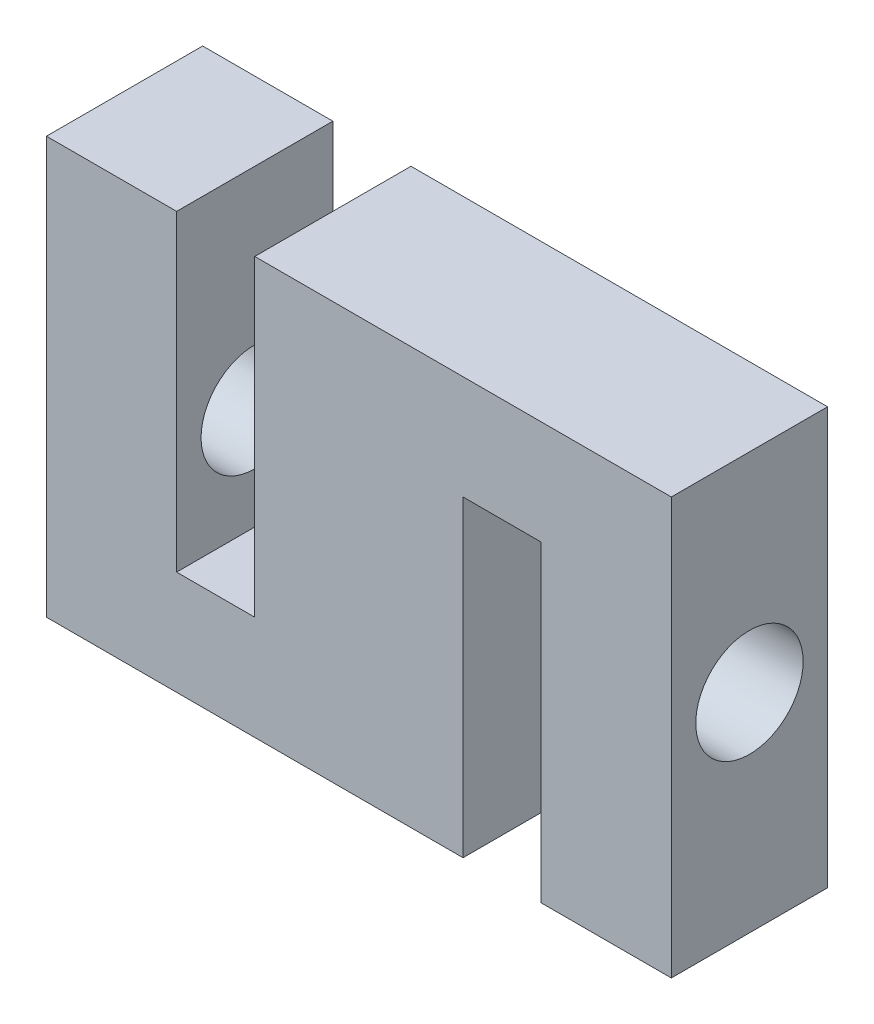
ISO-10303-21;
HEADER;
FILE_DESCRIPTION(('STEP AP214'),'2;1');
FILE_NAME('part.step','',(''),(''),'','','');
FILE_SCHEMA(('AUTOMOTIVE_DESIGN { 1 0 10303 214 1 1 1 1 }'));
ENDSEC;
DATA;
#1=APPLICATION_CONTEXT('core data for automotive mechanical design processes');
#2=APPLICATION_PROTOCOL_DEFINITION('international standard','automotive_design',2000,#1);
#3=PRODUCT_CONTEXT('',#1,'mechanical');
#4=PRODUCT('Part','Part','',(#3));
#5=PRODUCT_RELATED_PRODUCT_CATEGORY('part','',(#4));
#6=PRODUCT_DEFINITION_FORMATION('','',#4);
#7=PRODUCT_DEFINITION_CONTEXT('part definition',#1,'design');
#8=PRODUCT_DEFINITION('design','',#6,#7);
#9=PRODUCT_DEFINITION_SHAPE('','',#8);
#10=(LENGTH_UNIT() NAMED_UNIT(*) SI_UNIT(.MILLI.,.METRE.));
#11=(NAMED_UNIT(*) PLANE_ANGLE_UNIT() SI_UNIT($,.RADIAN.));
#12=(NAMED_UNIT(*) SI_UNIT($,.STERADIAN.) SOLID_ANGLE_UNIT());
#13=UNCERTAINTY_MEASURE_WITH_UNIT(LENGTH_MEASURE(1.E-05),#10,'distance_accuracy_value','');
#14=(GEOMETRIC_REPRESENTATION_CONTEXT(3) GLOBAL_UNCERTAINTY_ASSIGNED_CONTEXT((#13)) GLOBAL_UNIT_ASSIGNED_CONTEXT((#10,
#11,#12)) REPRESENTATION_CONTEXT('',''));
#15=CARTESIAN_POINT('',(0.,0.,0.));
#16=DIRECTION('',(0.,0.,1.));
#17=DIRECTION('',(1.,0.,0.));
#18=AXIS2_PLACEMENT_3D('',#15,#16,#17);
#19=CARTESIAN_POINT('',(50.8,0.,19.05));
#20=DIRECTION('',(0.,1.,0.));
#21=DIRECTION('',(-1.,0.,0.));
#22=AXIS2_PLACEMENT_3D('',#19,#20,#21);
#23=PLANE('',#22);
#24=DIRECTION('',(1.,0.,0.));
#25=VECTOR('',#24,1.);
#26=CARTESIAN_POINT('',(50.8,0.,0.));
#27=LINE('',#26,#25);
#28=CARTESIAN_POINT('',(0.,0.,0.));
#29=VERTEX_POINT('',#28);
#30=CARTESIAN_POINT('',(50.8,0.,0.));
#31=VERTEX_POINT('',#30);
#32=EDGE_CURVE('E164',#29,#31,#27,.T.);
#33=ORIENTED_EDGE('',*,*,#32,.T.);
#34=DIRECTION('',(0.,0.,-1.));
#35=VECTOR('',#34,1.);
#36=CARTESIAN_POINT('',(50.8,0.,19.05));
#37=LINE('',#36,#35);
#38=CARTESIAN_POINT('',(50.8,0.,19.05));
#39=VERTEX_POINT('',#38);
#40=EDGE_CURVE('E11',#39,#31,#37,.T.);
#41=ORIENTED_EDGE('',*,*,#40,.F.);
#42=DIRECTION('',(1.,0.,0.));
#43=VECTOR('',#42,1.);
#44=CARTESIAN_POINT('',(50.8,0.,19.05));
#45=LINE('',#44,#43);
#46=CARTESIAN_POINT('',(0.,0.,19.05));
#47=VERTEX_POINT('',#46);
#48=EDGE_CURVE('E199',#47,#39,#45,.T.);
#49=ORIENTED_EDGE('',*,*,#48,.F.);
#50=DIRECTION('',(0.,0.,-1.));
#51=VECTOR('',#50,1.);
#52=CARTESIAN_POINT('',(0.,0.,19.05));
#53=LINE('',#52,#51);
#54=EDGE_CURVE('E160',#47,#29,#53,.T.);
#55=ORIENTED_EDGE('',*,*,#54,.T.);
#56=EDGE_LOOP('',(#33,#41,#49,#55));
#57=FACE_BOUND('',#56,.T.);
#58=ADVANCED_FACE('F39',(#57),#23,.F.);
#59=CARTESIAN_POINT('',(50.8,38.1,19.05));
#60=DIRECTION('',(-1.,0.,0.));
#61=DIRECTION('',(0.,-1.,0.));
#62=AXIS2_PLACEMENT_3D('',#59,#60,#61);
#63=PLANE('',#62);
#64=DIRECTION('',(0.,1.,0.));
#65=VECTOR('',#64,1.);
#66=CARTESIAN_POINT('',(50.8,38.1,0.));
#67=LINE('',#66,#65);
#68=CARTESIAN_POINT('',(50.8,38.1,0.));
#69=VERTEX_POINT('',#68);
#70=EDGE_CURVE('E168',#31,#69,#67,.T.);
#71=ORIENTED_EDGE('',*,*,#70,.T.);
#72=DIRECTION('',(0.,0.,-1.));
#73=VECTOR('',#72,1.);
#74=CARTESIAN_POINT('',(50.8,38.1,19.05));
#75=LINE('',#74,#73);
#76=CARTESIAN_POINT('',(50.8,38.1,19.05));
#77=VERTEX_POINT('',#76);
#78=EDGE_CURVE('E48',#77,#69,#75,.T.);
#79=ORIENTED_EDGE('',*,*,#78,.F.);
#80=DIRECTION('',(0.,1.,0.));
#81=VECTOR('',#80,1.);
#82=CARTESIAN_POINT('',(50.8,38.1,19.05));
#83=LINE('',#82,#81);
#84=EDGE_CURVE('E111',#39,#77,#83,.T.);
#85=ORIENTED_EDGE('',*,*,#84,.F.);
#86=ORIENTED_EDGE('',*,*,#40,.T.);
#87=EDGE_LOOP('',(#71,#79,#85,#86));
#88=FACE_BOUND('',#87,.T.);
#89=ADVANCED_FACE('F295',(#88),#63,.F.);
#90=CARTESIAN_POINT('',(60.325,38.1,19.05));
#91=DIRECTION('',(0.,1.,0.));
#92=DIRECTION('',(0.,0.,1.));
#93=AXIS2_PLACEMENT_3D('',#90,#91,#92);
#94=PLANE('',#93);
#95=DIRECTION('',(1.,0.,0.));
#96=VECTOR('',#95,1.);
#97=CARTESIAN_POINT('',(60.325,38.1,0.));
#98=LINE('',#97,#96);
#99=CARTESIAN_POINT('',(60.325,38.1,0.));
#100=VERTEX_POINT('',#99);
#101=EDGE_CURVE('E172',#69,#100,#98,.T.);
#102=ORIENTED_EDGE('',*,*,#101,.T.);
#103=DIRECTION('',(0.,0.,-1.));
#104=VECTOR('',#103,1.);
#105=CARTESIAN_POINT('',(60.325,38.1,19.05));
#106=LINE('',#105,#104);
#107=CARTESIAN_POINT('',(60.325,38.1,19.05));
#108=VERTEX_POINT('',#107);
#109=EDGE_CURVE('E226',#108,#100,#106,.T.);
#110=ORIENTED_EDGE('',*,*,#109,.F.);
#111=DIRECTION('',(1.,0.,0.));
#112=VECTOR('',#111,1.);
#113=CARTESIAN_POINT('',(60.325,38.1,19.05));
#114=LINE('',#113,#112);
#115=EDGE_CURVE('E236',#77,#108,#114,.T.);
#116=ORIENTED_EDGE('',*,*,#115,.F.);
#117=ORIENTED_EDGE('',*,*,#78,.T.);
#118=EDGE_LOOP('',(#102,#110,#116,#117));
#119=FACE_BOUND('',#118,.T.);
#120=ADVANCED_FACE('F234',(#119),#94,.F.);
#121=CARTESIAN_POINT('',(60.325,0.,19.05));
#122=DIRECTION('',(1.,0.,0.));
#123=DIRECTION('',(0.,0.,-1.));
#124=AXIS2_PLACEMENT_3D('',#121,#122,#123);
#125=PLANE('',#124);
#126=CARTESIAN_POINT('',(60.325,25.4,9.525));
#127=DIRECTION('',(1.,0.,0.));
#128=DIRECTION('',(0.,0.,-1.));
#129=AXIS2_PLACEMENT_3D('',#126,#127,#128);
#130=CIRCLE('',#129,6.54811999999999);
#131=CARTESIAN_POINT('',(60.325,25.4,2.97688000000001));
#132=VERTEX_POINT('',#131);
#133=EDGE_CURVE('E333',#132,#132,#130,.T.);
#134=ORIENTED_EDGE('',*,*,#133,.T.);
#135=EDGE_LOOP('',(#134));
#136=FACE_BOUND('',#135,.T.);
#137=DIRECTION('',(0.,-1.,0.));
#138=VECTOR('',#137,1.);
#139=CARTESIAN_POINT('',(60.325,0.,0.));
#140=LINE('',#139,#138);
#141=CARTESIAN_POINT('',(60.325,0.,0.));
#142=VERTEX_POINT('',#141);
#143=EDGE_CURVE('E175',#100,#142,#140,.T.);
#144=ORIENTED_EDGE('',*,*,#143,.T.);
#145=DIRECTION('',(0.,0.,-1.));
#146=VECTOR('',#145,1.);
#147=CARTESIAN_POINT('',(60.325,0.,19.05));
#148=LINE('',#147,#146);
#149=CARTESIAN_POINT('',(60.325,0.,19.05));
#150=VERTEX_POINT('',#149);
#151=EDGE_CURVE('E222',#150,#142,#148,.T.);
#152=ORIENTED_EDGE('',*,*,#151,.F.);
#153=DIRECTION('',(0.,-1.,0.));
#154=VECTOR('',#153,1.);
#155=CARTESIAN_POINT('',(60.325,0.,19.05));
#156=LINE('',#155,#154);
#157=EDGE_CURVE('E255',#108,#150,#156,.T.);
#158=ORIENTED_EDGE('',*,*,#157,.F.);
#159=ORIENTED_EDGE('',*,*,#109,.T.);
#160=EDGE_LOOP('',(#144,#152,#158,#159));
#161=FACE_BOUND('',#160,.T.);
#162=ADVANCED_FACE('F245',(#136,#161),#125,.F.);
#163=CARTESIAN_POINT('',(76.2,0.,19.05));
#164=DIRECTION('',(0.,1.,0.));
#165=DIRECTION('',(-1.,0.,0.));
#166=AXIS2_PLACEMENT_3D('',#163,#164,#165);
#167=PLANE('',#166);
#168=DIRECTION('',(1.,0.,0.));
#169=VECTOR('',#168,1.);
#170=CARTESIAN_POINT('',(76.2,0.,0.));
#171=LINE('',#170,#169);
#172=CARTESIAN_POINT('',(76.2,0.,0.));
#173=VERTEX_POINT('',#172);
#174=EDGE_CURVE('E178',#142,#173,#171,.T.);
#175=ORIENTED_EDGE('',*,*,#174,.T.);
#176=DIRECTION('',(0.,0.,-1.));
#177=VECTOR('',#176,1.);
#178=CARTESIAN_POINT('',(76.2,0.,19.05));
#179=LINE('',#178,#177);
#180=CARTESIAN_POINT('',(76.2,0.,19.05));
#181=VERTEX_POINT('',#180);
#182=EDGE_CURVE('E218',#181,#173,#179,.T.);
#183=ORIENTED_EDGE('',*,*,#182,.F.);
#184=DIRECTION('',(1.,0.,0.));
#185=VECTOR('',#184,1.);
#186=CARTESIAN_POINT('',(76.2,0.,19.05));
#187=LINE('',#186,#185);
#188=EDGE_CURVE('E251',#150,#181,#187,.T.);
#189=ORIENTED_EDGE('',*,*,#188,.F.);
#190=ORIENTED_EDGE('',*,*,#151,.T.);
#191=EDGE_LOOP('',(#175,#183,#189,#190));
#192=FACE_BOUND('',#191,.T.);
#193=ADVANCED_FACE('F249',(#192),#167,.F.);
#194=CARTESIAN_POINT('',(76.2,50.8,19.05));
#195=DIRECTION('',(-1.,0.,0.));
#196=DIRECTION('',(0.,-1.,0.));
#197=AXIS2_PLACEMENT_3D('',#194,#195,#196);
#198=PLANE('',#197);
#199=CARTESIAN_POINT('',(76.2,25.4,9.525));
#200=DIRECTION('',(1.,0.,0.));
#201=DIRECTION('',(0.,0.,-1.));
#202=AXIS2_PLACEMENT_3D('',#199,#200,#201);
#203=CIRCLE('',#202,6.54811999999999);
#204=CARTESIAN_POINT('',(76.2,25.4,2.97688000000001));
#205=VERTEX_POINT('',#204);
#206=EDGE_CURVE('E344',#205,#205,#203,.T.);
#207=ORIENTED_EDGE('',*,*,#206,.F.);
#208=EDGE_LOOP('',(#207));
#209=FACE_BOUND('',#208,.T.);
#210=DIRECTION('',(0.,1.,0.));
#211=VECTOR('',#210,1.);
#212=CARTESIAN_POINT('',(76.2,50.8,0.));
#213=LINE('',#212,#211);
#214=CARTESIAN_POINT('',(76.2,50.8,0.));
#215=VERTEX_POINT('',#214);
#216=EDGE_CURVE('E181',#173,#215,#213,.T.);
#217=ORIENTED_EDGE('',*,*,#216,.T.);
#218=DIRECTION('',(0.,0.,-1.));
#219=VECTOR('',#218,1.);
#220=CARTESIAN_POINT('',(76.2,50.8,19.05));
#221=LINE('',#220,#219);
#222=CARTESIAN_POINT('',(76.2,50.8,19.05));
#223=VERTEX_POINT('',#222);
#224=EDGE_CURVE('E214',#223,#215,#221,.T.);
#225=ORIENTED_EDGE('',*,*,#224,.F.);
#226=DIRECTION('',(0.,1.,0.));
#227=VECTOR('',#226,1.);
#228=CARTESIAN_POINT('',(76.2,50.8,19.05));
#229=LINE('',#228,#227);
#230=EDGE_CURVE('E254',#181,#223,#229,.T.);
#231=ORIENTED_EDGE('',*,*,#230,.F.);
#232=ORIENTED_EDGE('',*,*,#182,.T.);
#233=EDGE_LOOP('',(#217,#225,#231,#232));
#234=FACE_BOUND('',#233,.T.);
#235=ADVANCED_FACE('F309',(#209,#234),#198,.F.);
#236=CARTESIAN_POINT('',(25.4,50.8,19.05));
#237=DIRECTION('',(0.,-1.,0.));
#238=DIRECTION('',(1.,0.,0.));
#239=AXIS2_PLACEMENT_3D('',#236,#237,#238);
#240=PLANE('',#239);
#241=DIRECTION('',(-1.,0.,0.));
#242=VECTOR('',#241,1.);
#243=CARTESIAN_POINT('',(25.4,50.8,0.));
#244=LINE('',#243,#242);
#245=CARTESIAN_POINT('',(25.4,50.8,0.));
#246=VERTEX_POINT('',#245);
#247=EDGE_CURVE('E184',#215,#246,#244,.T.);
#248=ORIENTED_EDGE('',*,*,#247,.T.);
#249=DIRECTION('',(0.,0.,-1.));
#250=VECTOR('',#249,1.);
#251=CARTESIAN_POINT('',(25.4,50.8,19.05));
#252=LINE('',#251,#250);
#253=CARTESIAN_POINT('',(25.4,50.8,19.05));
#254=VERTEX_POINT('',#253);
#255=EDGE_CURVE('E210',#254,#246,#252,.T.);
#256=ORIENTED_EDGE('',*,*,#255,.F.);
#257=DIRECTION('',(-1.,0.,0.));
#258=VECTOR('',#257,1.);
#259=CARTESIAN_POINT('',(25.4,50.8,19.05));
#260=LINE('',#259,#258);
#261=EDGE_CURVE('E259',#223,#254,#260,.T.);
#262=ORIENTED_EDGE('',*,*,#261,.F.);
#263=ORIENTED_EDGE('',*,*,#224,.T.);
#264=EDGE_LOOP('',(#248,#256,#262,#263));
#265=FACE_BOUND('',#264,.T.);
#266=ADVANCED_FACE('F312',(#265),#240,.F.);
#267=CARTESIAN_POINT('',(25.4,12.7,19.05));
#268=DIRECTION('',(1.,0.,0.));
#269=DIRECTION('',(0.,0.,-1.));
#270=AXIS2_PLACEMENT_3D('',#267,#268,#269);
#271=PLANE('',#270);
#272=DIRECTION('',(0.,-1.,0.));
#273=VECTOR('',#272,1.);
#274=CARTESIAN_POINT('',(25.4,12.7,0.));
#275=LINE('',#274,#273);
#276=CARTESIAN_POINT('',(25.4,12.7,0.));
#277=VERTEX_POINT('',#276);
#278=EDGE_CURVE('E187',#246,#277,#275,.T.);
#279=ORIENTED_EDGE('',*,*,#278,.T.);
#280=DIRECTION('',(0.,0.,-1.));
#281=VECTOR('',#280,1.);
#282=CARTESIAN_POINT('',(25.4,12.7,19.05));
#283=LINE('',#282,#281);
#284=CARTESIAN_POINT('',(25.4,12.7,19.05));
#285=VERTEX_POINT('',#284);
#286=EDGE_CURVE('E206',#285,#277,#283,.T.);
#287=ORIENTED_EDGE('',*,*,#286,.F.);
#288=DIRECTION('',(0.,-1.,0.));
#289=VECTOR('',#288,1.);
#290=CARTESIAN_POINT('',(25.4,12.7,19.05));
#291=LINE('',#290,#289);
#292=EDGE_CURVE('E266',#254,#285,#291,.T.);
#293=ORIENTED_EDGE('',*,*,#292,.F.);
#294=ORIENTED_EDGE('',*,*,#255,.T.);
#295=EDGE_LOOP('',(#279,#287,#293,#294));
#296=FACE_BOUND('',#295,.T.);
#297=ADVANCED_FACE('F274',(#296),#271,.F.);
#298=CARTESIAN_POINT('',(15.875,12.7,19.05));
#299=DIRECTION('',(0.,-1.,0.));
#300=DIRECTION('',(0.,0.,-1.));
#301=AXIS2_PLACEMENT_3D('',#298,#299,#300);
#302=PLANE('',#301);
#303=DIRECTION('',(-1.,0.,0.));
#304=VECTOR('',#303,1.);
#305=CARTESIAN_POINT('',(15.875,12.7,0.));
#306=LINE('',#305,#304);
#307=CARTESIAN_POINT('',(15.875,12.7,0.));
#308=VERTEX_POINT('',#307);
#309=EDGE_CURVE('E190',#277,#308,#306,.T.);
#310=ORIENTED_EDGE('',*,*,#309,.T.);
#311=DIRECTION('',(0.,0.,-1.));
#312=VECTOR('',#311,1.);
#313=CARTESIAN_POINT('',(15.875,12.7,19.05));
#314=LINE('',#313,#312);
#315=CARTESIAN_POINT('',(15.875,12.7,19.05));
#316=VERTEX_POINT('',#315);
#317=EDGE_CURVE('E153',#316,#308,#314,.T.);
#318=ORIENTED_EDGE('',*,*,#317,.F.);
#319=DIRECTION('',(-1.,0.,0.));
#320=VECTOR('',#319,1.);
#321=CARTESIAN_POINT('',(15.875,12.7,19.05));
#322=LINE('',#321,#320);
#323=EDGE_CURVE('E142',#285,#316,#322,.T.);
#324=ORIENTED_EDGE('',*,*,#323,.F.);
#325=ORIENTED_EDGE('',*,*,#286,.T.);
#326=EDGE_LOOP('',(#310,#318,#324,#325));
#327=FACE_BOUND('',#326,.T.);
#328=ADVANCED_FACE('F278',(#327),#302,.F.);
#329=CARTESIAN_POINT('',(15.875,50.8,19.05));
#330=DIRECTION('',(-1.,0.,0.));
#331=DIRECTION('',(0.,-1.,0.));
#332=AXIS2_PLACEMENT_3D('',#329,#330,#331);
#333=PLANE('',#332);
#334=CARTESIAN_POINT('',(15.875,25.4,9.525));
#335=DIRECTION('',(-1.,0.,0.));
#336=DIRECTION('',(0.,-1.,0.));
#337=AXIS2_PLACEMENT_3D('',#334,#335,#336);
#338=CIRCLE('',#337,6.54811999999999);
#339=CARTESIAN_POINT('',(15.875,18.85188,9.525));
#340=VERTEX_POINT('',#339);
#341=EDGE_CURVE('E169',#340,#340,#338,.T.);
#342=ORIENTED_EDGE('',*,*,#341,.T.);
#343=EDGE_LOOP('',(#342));
#344=FACE_BOUND('',#343,.T.);
#345=DIRECTION('',(0.,1.,0.));
#346=VECTOR('',#345,1.);
#347=CARTESIAN_POINT('',(15.875,50.8,0.));
#348=LINE('',#347,#346);
#349=CARTESIAN_POINT('',(15.875,50.8,0.));
#350=VERTEX_POINT('',#349);
#351=EDGE_CURVE('E151',#308,#350,#348,.T.);
#352=ORIENTED_EDGE('',*,*,#351,.T.);
#353=DIRECTION('',(0.,0.,-1.));
#354=VECTOR('',#353,1.);
#355=CARTESIAN_POINT('',(15.875,50.8,19.05));
#356=LINE('',#355,#354);
#357=CARTESIAN_POINT('',(15.875,50.8,19.05));
#358=VERTEX_POINT('',#357);
#359=EDGE_CURVE('E148',#358,#350,#356,.T.);
#360=ORIENTED_EDGE('',*,*,#359,.F.);
#361=DIRECTION('',(0.,1.,0.));
#362=VECTOR('',#361,1.);
#363=CARTESIAN_POINT('',(15.875,50.8,19.05));
#364=LINE('',#363,#362);
#365=EDGE_CURVE('E136',#316,#358,#364,.T.);
#366=ORIENTED_EDGE('',*,*,#365,.F.);
#367=ORIENTED_EDGE('',*,*,#317,.T.);
#368=EDGE_LOOP('',(#352,#360,#366,#367));
#369=FACE_BOUND('',#368,.T.);
#370=ADVANCED_FACE('F149',(#344,#369),#333,.F.);
#371=CARTESIAN_POINT('',(0.,50.8,19.05));
#372=DIRECTION('',(0.,-1.,0.));
#373=DIRECTION('',(0.,0.,-1.));
#374=AXIS2_PLACEMENT_3D('',#371,#372,#373);
#375=PLANE('',#374);
#376=DIRECTION('',(-1.,0.,0.));
#377=VECTOR('',#376,1.);
#378=CARTESIAN_POINT('',(0.,50.8,0.));
#379=LINE('',#378,#377);
#380=CARTESIAN_POINT('',(0.,50.8,0.));
#381=VERTEX_POINT('',#380);
#382=EDGE_CURVE('E97',#350,#381,#379,.T.);
#383=ORIENTED_EDGE('',*,*,#382,.T.);
#384=DIRECTION('',(0.,0.,-1.));
#385=VECTOR('',#384,1.);
#386=CARTESIAN_POINT('',(0.,50.8,19.05));
#387=LINE('',#386,#385);
#388=CARTESIAN_POINT('',(0.,50.8,19.05));
#389=VERTEX_POINT('',#388);
#390=EDGE_CURVE('E154',#389,#381,#387,.T.);
#391=ORIENTED_EDGE('',*,*,#390,.F.);
#392=DIRECTION('',(-1.,0.,0.));
#393=VECTOR('',#392,1.);
#394=CARTESIAN_POINT('',(0.,50.8,19.05));
#395=LINE('',#394,#393);
#396=EDGE_CURVE('E140',#358,#389,#395,.T.);
#397=ORIENTED_EDGE('',*,*,#396,.F.);
#398=ORIENTED_EDGE('',*,*,#359,.T.);
#399=EDGE_LOOP('',(#383,#391,#397,#398));
#400=FACE_BOUND('',#399,.T.);
#401=ADVANCED_FACE('F156',(#400),#375,.F.);
#402=CARTESIAN_POINT('',(0.,0.,19.05));
#403=DIRECTION('',(1.,0.,0.));
#404=DIRECTION('',(0.,0.,-1.));
#405=AXIS2_PLACEMENT_3D('',#402,#403,#404);
#406=PLANE('',#405);
#407=CARTESIAN_POINT('',(0.,25.4,9.525));
#408=DIRECTION('',(-1.,0.,0.));
#409=DIRECTION('',(0.,0.,1.));
#410=AXIS2_PLACEMENT_3D('',#407,#408,#409);
#411=CIRCLE('',#410,6.54811999999998);
#412=CARTESIAN_POINT('',(0.,25.4,16.07312));
#413=VERTEX_POINT('',#412);
#414=EDGE_CURVE('E329',#413,#413,#411,.T.);
#415=ORIENTED_EDGE('',*,*,#414,.F.);
#416=EDGE_LOOP('',(#415));
#417=FACE_BOUND('',#416,.T.);
#418=DIRECTION('',(0.,-1.,0.));
#419=VECTOR('',#418,1.);
#420=CARTESIAN_POINT('',(0.,0.,0.));
#421=LINE('',#420,#419);
#422=EDGE_CURVE('E103',#381,#29,#421,.T.);
#423=ORIENTED_EDGE('',*,*,#422,.T.);
#424=ORIENTED_EDGE('',*,*,#54,.F.);
#425=DIRECTION('',(0.,-1.,0.));
#426=VECTOR('',#425,1.);
#427=CARTESIAN_POINT('',(0.,0.,19.05));
#428=LINE('',#427,#426);
#429=EDGE_CURVE('E56',#389,#47,#428,.T.);
#430=ORIENTED_EDGE('',*,*,#429,.F.);
#431=ORIENTED_EDGE('',*,*,#390,.T.);
#432=EDGE_LOOP('',(#423,#424,#430,#431));
#433=FACE_BOUND('',#432,.T.);
#434=ADVANCED_FACE('F282',(#417,#433),#406,.F.);
#435=CARTESIAN_POINT('',(0.,0.,19.05));
#436=DIRECTION('',(0.,0.,-1.));
#437=DIRECTION('',(-1.,0.,0.));
#438=AXIS2_PLACEMENT_3D('',#435,#436,#437);
#439=PLANE('',#438);
#440=ORIENTED_EDGE('',*,*,#48,.T.);
#441=ORIENTED_EDGE('',*,*,#84,.T.);
#442=ORIENTED_EDGE('',*,*,#115,.T.);
#443=ORIENTED_EDGE('',*,*,#157,.T.);
#444=ORIENTED_EDGE('',*,*,#188,.T.);
#445=ORIENTED_EDGE('',*,*,#230,.T.);
#446=ORIENTED_EDGE('',*,*,#261,.T.);
#447=ORIENTED_EDGE('',*,*,#292,.T.);
#448=ORIENTED_EDGE('',*,*,#323,.T.);
#449=ORIENTED_EDGE('',*,*,#365,.T.);
#450=ORIENTED_EDGE('',*,*,#396,.T.);
#451=ORIENTED_EDGE('',*,*,#429,.T.);
#452=EDGE_LOOP('',(#440,#441,#442,#443,#444,#445,#446,#447,#448,#449,#450,#451));
#453=FACE_BOUND('',#452,.T.);
#454=ADVANCED_FACE('F138',(#453),#439,.F.);
#455=CARTESIAN_POINT('',(0.,0.,0.));
#456=DIRECTION('',(0.,0.,-1.));
#457=DIRECTION('',(-1.,0.,0.));
#458=AXIS2_PLACEMENT_3D('',#455,#456,#457);
#459=PLANE('',#458);
#460=ORIENTED_EDGE('',*,*,#32,.F.);
#461=ORIENTED_EDGE('',*,*,#422,.F.);
#462=ORIENTED_EDGE('',*,*,#382,.F.);
#463=ORIENTED_EDGE('',*,*,#351,.F.);
#464=ORIENTED_EDGE('',*,*,#309,.F.);
#465=ORIENTED_EDGE('',*,*,#278,.F.);
#466=ORIENTED_EDGE('',*,*,#247,.F.);
#467=ORIENTED_EDGE('',*,*,#216,.F.);
#468=ORIENTED_EDGE('',*,*,#174,.F.);
#469=ORIENTED_EDGE('',*,*,#143,.F.);
#470=ORIENTED_EDGE('',*,*,#101,.F.);
#471=ORIENTED_EDGE('',*,*,#70,.F.);
#472=EDGE_LOOP('',(#460,#461,#462,#463,#464,#465,#466,#467,#468,#469,#470,#471));
#473=FACE_BOUND('',#472,.T.);
#474=ADVANCED_FACE('F240',(#473),#459,.T.);
#475=CARTESIAN_POINT('',(0.,25.4,9.525));
#476=DIRECTION('',(-1.,0.,0.));
#477=DIRECTION('',(0.,0.,1.));
#478=AXIS2_PLACEMENT_3D('',#475,#476,#477);
#479=CYLINDRICAL_SURFACE('',#478,6.54811999999999);
#480=ORIENTED_EDGE('',*,*,#341,.F.);
#481=EDGE_LOOP('',(#480));
#482=FACE_BOUND('',#481,.T.);
#483=ORIENTED_EDGE('',*,*,#414,.T.);
#484=EDGE_LOOP('',(#483));
#485=FACE_BOUND('',#484,.T.);
#486=ADVANCED_FACE('F354',(#482,#485),#479,.F.);
#487=CARTESIAN_POINT('',(76.2,25.4,9.525));
#488=DIRECTION('',(1.,0.,0.));
#489=DIRECTION('',(0.,0.,-1.));
#490=AXIS2_PLACEMENT_3D('',#487,#488,#489);
#491=CYLINDRICAL_SURFACE('',#490,6.54811999999999);
#492=ORIENTED_EDGE('',*,*,#133,.F.);
#493=EDGE_LOOP('',(#492));
#494=FACE_BOUND('',#493,.T.);
#495=ORIENTED_EDGE('',*,*,#206,.T.);
#496=EDGE_LOOP('',(#495));
#497=FACE_BOUND('',#496,.T.);
#498=ADVANCED_FACE('F349',(#494,#497),#491,.F.);
#499=CLOSED_SHELL('',(#58,#89,#120,#162,#193,#235,#266,#297,#328,#370,#401,#434,#454,#474,#486,#498));
#500=MANIFOLD_SOLID_BREP('B2',#499);
#501=ADVANCED_BREP_SHAPE_REPRESENTATION('',(#18,#500),#14);
#502=SHAPE_DEFINITION_REPRESENTATION(#9,#501);
ENDSEC;
END-ISO-10303-21;
